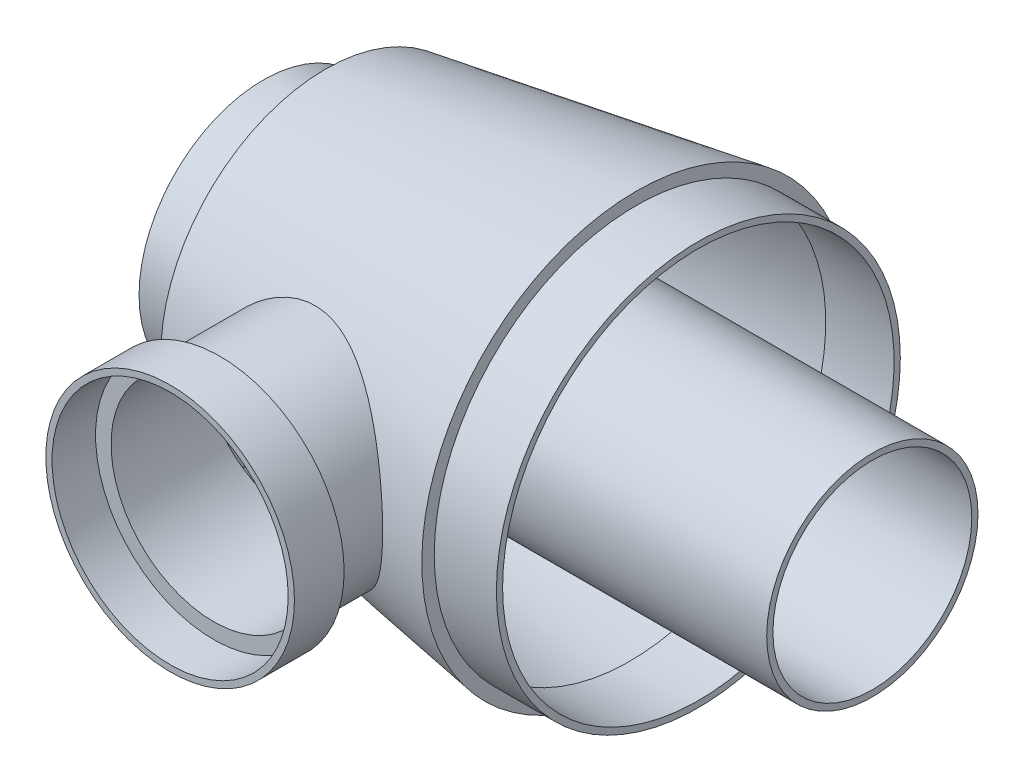
ISO-10303-21;
HEADER;
FILE_DESCRIPTION(('STEP AP214'),'2;1');
FILE_NAME('part.step','',(''),(''),'','','');
FILE_SCHEMA(('AUTOMOTIVE_DESIGN { 1 0 10303 214 1 1 1 1 }'));
ENDSEC;
DATA;
#1=APPLICATION_CONTEXT('core data for automotive mechanical design processes');
#2=APPLICATION_PROTOCOL_DEFINITION('international standard','automotive_design',2000,#1);
#3=PRODUCT_CONTEXT('',#1,'mechanical');
#4=PRODUCT('Part','Part','',(#3));
#5=PRODUCT_RELATED_PRODUCT_CATEGORY('part','',(#4));
#6=PRODUCT_DEFINITION_FORMATION('','',#4);
#7=PRODUCT_DEFINITION_CONTEXT('part definition',#1,'design');
#8=PRODUCT_DEFINITION('design','',#6,#7);
#9=PRODUCT_DEFINITION_SHAPE('','',#8);
#10=(LENGTH_UNIT() NAMED_UNIT(*) SI_UNIT(.MILLI.,.METRE.));
#11=(NAMED_UNIT(*) PLANE_ANGLE_UNIT() SI_UNIT($,.RADIAN.));
#12=(NAMED_UNIT(*) SI_UNIT($,.STERADIAN.) SOLID_ANGLE_UNIT());
#13=UNCERTAINTY_MEASURE_WITH_UNIT(LENGTH_MEASURE(1.E-05),#10,'distance_accuracy_value','');
#14=(GEOMETRIC_REPRESENTATION_CONTEXT(3) GLOBAL_UNCERTAINTY_ASSIGNED_CONTEXT((#13)) GLOBAL_UNIT_ASSIGNED_CONTEXT((#10,
#11,#12)) REPRESENTATION_CONTEXT('',''));
#15=CARTESIAN_POINT('',(0.,0.,0.));
#16=DIRECTION('',(0.,0.,1.));
#17=DIRECTION('',(1.,0.,0.));
#18=AXIS2_PLACEMENT_3D('',#15,#16,#17);
#19=CARTESIAN_POINT('',(35.,0.,42.));
#20=DIRECTION('',(0.,0.,1.));
#21=DIRECTION('',(1.,0.,0.));
#22=AXIS2_PLACEMENT_3D('',#19,#20,#21);
#23=CYLINDRICAL_SURFACE('',#22,20.);
#24=CARTESIAN_POINT('',(35.,0.,42.));
#25=DIRECTION('',(0.,0.,1.));
#26=DIRECTION('',(1.,0.,0.));
#27=AXIS2_PLACEMENT_3D('',#24,#25,#26);
#28=CIRCLE('',#27,20.);
#29=CARTESIAN_POINT('',(55.,0.,42.));
#30=VERTEX_POINT('',#29);
#31=EDGE_CURVE('E19',#30,#30,#28,.T.);
#32=ORIENTED_EDGE('',*,*,#31,.T.);
#33=EDGE_LOOP('',(#32));
#34=FACE_BOUND('',#33,.T.);
#35=CARTESIAN_POINT('',(35.,0.,50.));
#36=DIRECTION('',(0.,0.,1.));
#37=DIRECTION('',(1.,0.,0.));
#38=AXIS2_PLACEMENT_3D('',#35,#36,#37);
#39=CIRCLE('',#38,20.);
#40=CARTESIAN_POINT('',(55.,0.,50.));
#41=VERTEX_POINT('',#40);
#42=EDGE_CURVE('E213',#41,#41,#39,.T.);
#43=ORIENTED_EDGE('',*,*,#42,.F.);
#44=EDGE_LOOP('',(#43));
#45=FACE_BOUND('',#44,.T.);
#46=ADVANCED_FACE('F16',(#34,#45),#23,.T.);
#47=CARTESIAN_POINT('',(35.,0.,42.));
#48=DIRECTION('',(0.,0.,1.));
#49=DIRECTION('',(1.,0.,0.));
#50=AXIS2_PLACEMENT_3D('',#47,#48,#49);
#51=PLANE('',#50);
#52=ORIENTED_EDGE('',*,*,#31,.F.);
#53=EDGE_LOOP('',(#52));
#54=FACE_BOUND('',#53,.T.);
#55=CARTESIAN_POINT('',(35.,0.,42.));
#56=DIRECTION('',(0.,0.,1.));
#57=DIRECTION('',(1.,0.,0.));
#58=AXIS2_PLACEMENT_3D('',#55,#56,#57);
#59=CIRCLE('',#58,17.5);
#60=CARTESIAN_POINT('',(52.5,0.,42.));
#61=VERTEX_POINT('',#60);
#62=EDGE_CURVE('E206',#61,#61,#59,.F.);
#63=ORIENTED_EDGE('',*,*,#62,.F.);
#64=EDGE_LOOP('',(#63));
#65=FACE_BOUND('',#64,.T.);
#66=ADVANCED_FACE('F223',(#54,#65),#51,.F.);
#67=CARTESIAN_POINT('',(35.,0.,50.));
#68=DIRECTION('',(0.,0.,1.));
#69=DIRECTION('',(1.,0.,0.));
#70=AXIS2_PLACEMENT_3D('',#67,#68,#69);
#71=PLANE('',#70);
#72=ORIENTED_EDGE('',*,*,#42,.T.);
#73=EDGE_LOOP('',(#72));
#74=FACE_BOUND('',#73,.T.);
#75=CARTESIAN_POINT('',(35.,0.,50.));
#76=DIRECTION('',(0.,0.,1.));
#77=DIRECTION('',(1.,0.,0.));
#78=AXIS2_PLACEMENT_3D('',#75,#76,#77);
#79=CIRCLE('',#78,19.);
#80=CARTESIAN_POINT('',(54.,0.,50.));
#81=VERTEX_POINT('',#80);
#82=EDGE_CURVE('E174',#81,#81,#79,.F.);
#83=ORIENTED_EDGE('',*,*,#82,.T.);
#84=EDGE_LOOP('',(#83));
#85=FACE_BOUND('',#84,.T.);
#86=ADVANCED_FACE('F225',(#74,#85),#71,.T.);
#87=CARTESIAN_POINT('',(70.,0.,0.));
#88=DIRECTION('',(-1.,0.,0.));
#89=DIRECTION('',(0.,0.,1.));
#90=AXIS2_PLACEMENT_3D('',#87,#88,#89);
#91=CYLINDRICAL_SURFACE('',#90,32.5);
#92=CARTESIAN_POINT('',(60.,0.,0.));
#93=DIRECTION('',(-1.,0.,0.));
#94=DIRECTION('',(0.,0.,1.));
#95=AXIS2_PLACEMENT_3D('',#92,#93,#94);
#96=CIRCLE('',#95,32.5);
#97=CARTESIAN_POINT('',(60.,0.,32.5));
#98=VERTEX_POINT('',#97);
#99=EDGE_CURVE('E208',#98,#98,#96,.F.);
#100=ORIENTED_EDGE('',*,*,#99,.T.);
#101=EDGE_LOOP('',(#100));
#102=FACE_BOUND('',#101,.T.);
#103=CARTESIAN_POINT('',(70.,0.,0.));
#104=DIRECTION('',(-1.,0.,0.));
#105=DIRECTION('',(0.,0.,1.));
#106=AXIS2_PLACEMENT_3D('',#103,#104,#105);
#107=CIRCLE('',#106,32.5);
#108=CARTESIAN_POINT('',(70.,0.,32.5));
#109=VERTEX_POINT('',#108);
#110=EDGE_CURVE('E210',#109,#109,#107,.T.);
#111=ORIENTED_EDGE('',*,*,#110,.T.);
#112=EDGE_LOOP('',(#111));
#113=FACE_BOUND('',#112,.T.);
#114=ADVANCED_FACE('F230',(#102,#113),#91,.T.);
#115=CARTESIAN_POINT('',(60.,34.5,0.));
#116=DIRECTION('',(-1.,0.,0.));
#117=DIRECTION('',(0.,0.,1.));
#118=AXIS2_PLACEMENT_3D('',#115,#116,#117);
#119=PLANE('',#118);
#120=ORIENTED_EDGE('',*,*,#99,.F.);
#121=EDGE_LOOP('',(#120));
#122=FACE_BOUND('',#121,.T.);
#123=CARTESIAN_POINT('',(60.,0.,0.));
#124=DIRECTION('',(1.,0.,0.));
#125=DIRECTION('',(0.,1.,0.));
#126=AXIS2_PLACEMENT_3D('',#123,#124,#125);
#127=CIRCLE('',#126,34.5);
#128=CARTESIAN_POINT('',(60.,34.5,0.));
#129=VERTEX_POINT('',#128);
#130=EDGE_CURVE('E146',#129,#129,#127,.F.);
#131=ORIENTED_EDGE('',*,*,#130,.F.);
#132=EDGE_LOOP('',(#131));
#133=FACE_BOUND('',#132,.T.);
#134=ADVANCED_FACE('F169',(#122,#133),#119,.F.);
#135=CARTESIAN_POINT('',(35.,0.,22.));
#136=DIRECTION('',(0.,0.,1.));
#137=DIRECTION('',(1.,0.,0.));
#138=AXIS2_PLACEMENT_3D('',#135,#136,#137);
#139=CYLINDRICAL_SURFACE('',#138,17.5);
#140=CARTESIAN_POINT('',(52.5,0.,33.3));
#141=CARTESIAN_POINT('',(52.5000001885617,-0.435514880047638,33.3000001647978));
#142=CARTESIAN_POINT('',(52.4837205137714,-0.871027411837084,33.288833379642));
#143=CARTESIAN_POINT('',(52.4188637930748,-1.73849528465294,33.2444253033912));
#144=CARTESIAN_POINT('',(52.3702868694326,-2.17045063913908,33.2111840958606));
#145=CARTESIAN_POINT('',(52.2415761391305,-3.02752388525962,33.1233690582033));
#146=CARTESIAN_POINT('',(52.1614344615851,-3.45264004395322,33.0687899073406));
#147=CARTESIAN_POINT('',(51.9707695009141,-4.29285236538596,32.9394834890912));
#148=CARTESIAN_POINT('',(51.860245810111,-4.7079483935899,32.864755951346));
#149=CARTESIAN_POINT('',(51.6108886236791,-5.52353065288265,32.6970736088742));
#150=CARTESIAN_POINT('',(51.4721897023269,-5.92407604323885,32.6042055275321));
#151=CARTESIAN_POINT('',(51.1678222816258,-6.71038546833239,32.4017703364357));
#152=CARTESIAN_POINT('',(51.0021539318685,-7.09614958504251,32.2922033193057));
#153=CARTESIAN_POINT('',(50.6455907022969,-7.85109964612951,32.0582757546495));
#154=CARTESIAN_POINT('',(50.4546978635142,-8.2202869285809,31.9339164041214));
#155=CARTESIAN_POINT('',(50.0493038392447,-8.94088669598188,31.6723166441191));
#156=CARTESIAN_POINT('',(49.8347922594044,-9.29229125484885,31.5350705672787));
#157=CARTESIAN_POINT('',(49.3654045980992,-10.0040717640414,31.2380686202952));
#158=CARTESIAN_POINT('',(49.1086621512373,-10.3628311834943,31.0773897966443));
#159=CARTESIAN_POINT('',(48.5714024328761,-11.0571133689343,30.7458679388734));
#160=CARTESIAN_POINT('',(48.2908824075215,-11.3926334352024,30.5750237281103));
#161=CARTESIAN_POINT('',(47.707580017081,-12.0398216567162,30.225581436072));
#162=CARTESIAN_POINT('',(47.404783755731,-12.3514746716692,30.046978543747));
#163=CARTESIAN_POINT('',(46.7785394103549,-12.9500446630985,29.6846154029511));
#164=CARTESIAN_POINT('',(46.4550900934565,-13.2369601604756,29.5008548469641));
#165=CARTESIAN_POINT('',(45.7319440771263,-13.8322277277014,29.0991027890746));
#166=CARTESIAN_POINT('',(45.3286510849446,-14.1358914850356,28.8806178225669));
#167=CARTESIAN_POINT('',(44.4971423408468,-14.7074424944182,28.4441060058974));
#168=CARTESIAN_POINT('',(44.0689227476929,-14.9753242113168,28.2260792317362));
#169=CARTESIAN_POINT('',(43.1890520091183,-15.4740158027962,27.7947919226038));
#170=CARTESIAN_POINT('',(42.7373989912583,-15.7048227088735,27.5815317704618));
#171=CARTESIAN_POINT('',(41.8121817001478,-16.127703136979,27.1644031015593));
#172=CARTESIAN_POINT('',(41.3386212881079,-16.3197834528896,26.9605329423441));
#173=CARTESIAN_POINT('',(40.4431947787179,-16.6376837151577,26.5963652213721));
#174=CARTESIAN_POINT('',(40.0241167562621,-16.769109746912,26.4340970552161));
#175=CARTESIAN_POINT('',(39.1725919032671,-17.0010035169377,26.1231520842414));
#176=CARTESIAN_POINT('',(38.7401476430482,-17.1014771670802,25.9744726878027));
#177=CARTESIAN_POINT('',(37.8639669328961,-17.2698142096295,25.6941171167669));
#178=CARTESIAN_POINT('',(37.4202416023485,-17.3377084951832,25.5624249211881));
#179=CARTESIAN_POINT('',(36.523414205113,-17.4394043647639,25.3191112631481));
#180=CARTESIAN_POINT('',(36.0703121882672,-17.4732061299634,25.2074896940312));
#181=CARTESIAN_POINT('',(35.1538221348332,-17.5053803154321,25.0063724890001));
#182=CARTESIAN_POINT('',(34.6903791443841,-17.5034454636346,24.9170754448765));
#183=CARTESIAN_POINT('',(33.7608732806475,-17.4622717598489,24.7641933706335));
#184=CARTESIAN_POINT('',(33.2948104414534,-17.4230333921977,24.700608006697));
#185=CARTESIAN_POINT('',(32.3647074804768,-17.3067839898081,24.6004657435728));
#186=CARTESIAN_POINT('',(31.900666496604,-17.2297910606023,24.5638959098988));
#187=CARTESIAN_POINT('',(30.9790585527083,-17.0382944510775,24.5177546858264));
#188=CARTESIAN_POINT('',(30.5214910013201,-16.9237942205359,24.508180813221));
#189=CARTESIAN_POINT('',(29.6773176305309,-16.675915870004,24.5142599625784));
#190=CARTESIAN_POINT('',(29.2893477214467,-16.5470543206926,24.5267361723959));
#191=CARTESIAN_POINT('',(28.5242202967475,-16.2628660625055,24.5694124122359));
#192=CARTESIAN_POINT('',(28.1470632493092,-16.1075382097036,24.5996132084883));
#193=CARTESIAN_POINT('',(27.4057310541674,-15.7715810942508,24.6756906876631));
#194=CARTESIAN_POINT('',(27.0415597750358,-15.5909443695754,24.7215719995648));
#195=CARTESIAN_POINT('',(26.3281299907874,-15.2056915103234,24.8266235629821));
#196=CARTESIAN_POINT('',(25.978872573067,-15.0010736312966,24.8857947815264));
#197=CARTESIAN_POINT('',(25.2763627250643,-14.5562330831914,25.0187436513646));
#198=CARTESIAN_POINT('',(24.9241215196031,-14.3146126254544,25.0931834013906));
#199=CARTESIAN_POINT('',(24.2393925734692,-13.8072801824645,25.2510855287426));
#200=CARTESIAN_POINT('',(23.906912846272,-13.5415585327886,25.3345515281395));
#201=CARTESIAN_POINT('',(23.2629142204999,-12.9873540699492,25.5075075434977));
#202=CARTESIAN_POINT('',(22.9514048122304,-12.6988610780232,25.5970002507359));
#203=CARTESIAN_POINT('',(22.3507081126254,-12.10062226396,25.7790496391801));
#204=CARTESIAN_POINT('',(22.0615139021038,-11.7908830862691,25.8716053578283));
#205=CARTESIAN_POINT('',(21.4640206291457,-11.102496810575,26.0712197339636));
#206=CARTESIAN_POINT('',(21.1595359513443,-10.7205454781855,26.1783371334227));
#207=CARTESIAN_POINT('',(20.5831085787734,-9.93186023769735,26.3891014546844));
#208=CARTESIAN_POINT('',(20.3111697762292,-9.52512337420889,26.4927479603307));
#209=CARTESIAN_POINT('',(19.8015359307782,-8.68887233935458,26.692941701183));
#210=CARTESIAN_POINT('',(19.5638511411799,-8.25935140041192,26.789486806499));
#211=CARTESIAN_POINT('',(19.1246808460303,-7.38008499940052,26.9720851483386));
#212=CARTESIAN_POINT('',(18.923189919941,-6.93034257841727,27.0581399553101));
#213=CARTESIAN_POINT('',(18.5735360891063,-6.05191042809246,27.2101211065048));
#214=CARTESIAN_POINT('',(18.4223160588068,-5.62462367457826,27.2771308326202));
#215=CARTESIAN_POINT('',(18.153064586301,-4.75780479728101,27.3978823067612));
#216=CARTESIAN_POINT('',(18.0350363223189,-4.31827150527614,27.4516227841511));
#217=CARTESIAN_POINT('',(17.8336082683842,-3.4309593640391,27.5440867723587));
#218=CARTESIAN_POINT('',(17.7501227135078,-2.98320385474274,27.5828474599982));
#219=CARTESIAN_POINT('',(17.618283138227,-2.08164431089274,27.6443368492865));
#220=CARTESIAN_POINT('',(17.5699085773306,-1.62784397117048,27.6670749241922));
#221=CARTESIAN_POINT('',(17.5262322204475,-0.977612064182942,27.6876326767116));
#222=CARTESIAN_POINT('',(17.5163986764441,-0.782265258662365,27.6922668714081));
#223=CARTESIAN_POINT('',(17.5032815147621,-0.391287499017272,27.6984514329303));
#224=CARTESIAN_POINT('',(17.499998440106,-0.195656522680652,27.7000015440908));
#225=CARTESIAN_POINT('',(17.5000037114248,0.465521682802774,27.6999963261754));
#226=CARTESIAN_POINT('',(17.5186016539162,0.931187982797091,27.6912087721844));
#227=CARTESIAN_POINT('',(17.5928011160104,1.85911370886413,27.656324892269));
#228=CARTESIAN_POINT('',(17.6484255568552,2.32137084516253,27.6302178447516));
#229=CARTESIAN_POINT('',(17.7962136731854,3.239837928326,27.5614534780341));
#230=CARTESIAN_POINT('',(17.8884595303035,3.69603187283546,27.5187589397028));
#231=CARTESIAN_POINT('',(18.1084581062748,4.59796534088753,27.418190452287));
#232=CARTESIAN_POINT('',(18.2362056226055,5.04370638585972,27.3603187273843));
#233=CARTESIAN_POINT('',(18.525318850132,5.92004061628944,27.2314754988789));
#234=CARTESIAN_POINT('',(18.6865399182106,6.35068995154468,27.1605605025107));
#235=CARTESIAN_POINT('',(19.0415109249152,7.19631331921828,27.0076230522582));
#236=CARTESIAN_POINT('',(19.2352619782466,7.6112868138753,26.9256002177601));
#237=CARTESIAN_POINT('',(19.6537647573784,8.42328030059347,26.7529291158927));
#238=CARTESIAN_POINT('',(19.878509678318,8.82030420823998,26.6622827432161));
#239=CARTESIAN_POINT('',(20.3575729573521,9.59461428550394,26.4750667748695));
#240=CARTESIAN_POINT('',(20.6118923667846,9.97189975275152,26.3784969686862));
#241=CARTESIAN_POINT('',(21.1650653039191,10.7273912412964,26.1764030786938));
#242=CARTESIAN_POINT('',(21.4656880851636,11.1042528871753,26.0706919106337));
#243=CARTESIAN_POINT('',(22.0970527346055,11.8319919458249,25.8597033102133));
#244=CARTESIAN_POINT('',(22.4277959036973,12.1828682351046,25.7544258967924));
#245=CARTESIAN_POINT('',(23.1180136373974,12.8569514336609,25.5483091518454));
#246=CARTESIAN_POINT('',(23.4775025175717,13.1801443884097,25.4474720708876));
#247=CARTESIAN_POINT('',(24.2236181009056,13.7968824748227,25.2545519587817));
#248=CARTESIAN_POINT('',(24.6102583794879,14.0904125938929,25.162473361742));
#249=CARTESIAN_POINT('',(25.4230098160746,14.6555423050323,24.9885539437974));
#250=CARTESIAN_POINT('',(25.8500401238753,14.9259746274561,24.9071999808744));
#251=CARTESIAN_POINT('',(26.7281503947872,15.429923556908,24.763876332879));
#252=CARTESIAN_POINT('',(27.1792145874679,15.6634639820815,24.7018941155157));
#253=CARTESIAN_POINT('',(28.1015424037587,16.0909669834629,24.6020903780272));
#254=CARTESIAN_POINT('',(28.5727749825542,16.2849879151772,24.5642330558864));
#255=CARTESIAN_POINT('',(29.5316303896368,16.6314947116193,24.5165747683613));
#256=CARTESIAN_POINT('',(30.0192495592468,16.7839897796235,24.506767581707));
#257=CARTESIAN_POINT('',(30.9379605332263,17.0277360777489,24.5171605507704));
#258=CARTESIAN_POINT('',(31.3676400899309,17.1245166367544,24.533432222474));
#259=CARTESIAN_POINT('',(32.2315520348977,17.2852153958602,24.5896317343174));
#260=CARTESIAN_POINT('',(32.6657839825681,17.3491367467374,24.6295573055608));
#261=CARTESIAN_POINT('',(33.5351213007296,17.4440648788335,24.7328198622028));
#262=CARTESIAN_POINT('',(33.9702268283901,17.475065081448,24.7961615234103));
#263=CARTESIAN_POINT('',(34.8377070852669,17.5046287200725,24.9450514671758));
#264=CARTESIAN_POINT('',(35.2700817819588,17.5031917704782,25.0306000137114));
#265=CARTESIAN_POINT('',(36.0973209937646,17.4701009739637,25.2148813661205));
#266=CARTESIAN_POINT('',(36.4926007693681,17.4406827462883,25.3121771162279));
#267=CARTESIAN_POINT('',(37.2762919332233,17.3558033956794,25.5222302698023));
#268=CARTESIAN_POINT('',(37.6647011173631,17.3003340672228,25.6349925369535));
#269=CARTESIAN_POINT('',(38.4329389960852,17.1644129222405,25.8738318436419));
#270=CARTESIAN_POINT('',(38.8127678456648,17.0839615573841,25.9999086424284));
#271=CARTESIAN_POINT('',(39.5625275647684,16.8991876021323,26.2631477769459));
#272=CARTESIAN_POINT('',(39.9324580459977,16.7948640768051,26.400310546713));
#273=CARTESIAN_POINT('',(41.1394191639469,16.4115229280071,26.8692711051179));
#274=CARTESIAN_POINT('',(41.953789809296,16.0826313323453,27.2207464480039));
#275=CARTESIAN_POINT('',(43.125053317887,15.505601302697,27.7647837804665));
#276=CARTESIAN_POINT('',(43.5073815241038,15.299108017455,27.9490896603059));
#277=CARTESIAN_POINT('',(44.2547390026713,14.8589269711023,28.3206725321907));
#278=CARTESIAN_POINT('',(44.619767225811,14.6252375635612,28.5079497035224));
#279=CARTESIAN_POINT('',(45.3996224105337,14.0841851467013,28.9186191025356));
#280=CARTESIAN_POINT('',(45.8105915981076,13.7712849366772,29.1420563914461));
#281=CARTESIAN_POINT('',(46.6046271790621,13.1091534373625,29.5848507245715));
#282=CARTESIAN_POINT('',(46.9876889220987,12.7599161164902,29.8042070842484));
#283=CARTESIAN_POINT('',(47.7235596634945,12.0262532820401,30.2344630515727));
#284=CARTESIAN_POINT('',(48.0763795386315,11.6418405233658,30.4453656850317));
#285=CARTESIAN_POINT('',(48.5808536944968,11.0398801374827,30.7521033940362));
#286=CARTESIAN_POINT('',(48.7448780812918,10.8350142115877,30.8527417102087));
#287=CARTESIAN_POINT('',(49.064393796179,10.4169127045727,31.0503316611592));
#288=CARTESIAN_POINT('',(49.2198829149269,10.2036749806941,31.1472823394208));
#289=CARTESIAN_POINT('',(49.621993774098,9.62501336043149,31.3997911163116));
#290=CARTESIAN_POINT('',(49.8607141220181,9.25239335986416,31.5516051545745));
#291=CARTESIAN_POINT('',(50.31126521356,8.48602999112209,31.8409045850368));
#292=CARTESIAN_POINT('',(50.5231008673783,8.09229049893479,31.9783925929063));
#293=CARTESIAN_POINT('',(50.9176796951318,7.28552852061569,32.2365036512779));
#294=CARTESIAN_POINT('',(51.1004445193146,6.87252068370759,32.3571392442404));
#295=CARTESIAN_POINT('',(51.4348926404308,6.02910076115754,32.5792664035894));
#296=CARTESIAN_POINT('',(51.5865774142271,5.59868950365606,32.6807588796009));
#297=CARTESIAN_POINT('',(51.8488417280902,4.74894175308454,32.8570587201349));
#298=CARTESIAN_POINT('',(51.9613143763606,4.33044313955341,32.9330846209898));
#299=CARTESIAN_POINT('',(52.1553590786361,3.48317269239629,33.0646572124483));
#300=CARTESIAN_POINT('',(52.2369327524217,3.05440139853615,33.1202049765491));
#301=CARTESIAN_POINT('',(52.3679488053152,2.18984997482909,33.2095851646815));
#302=CARTESIAN_POINT('',(52.4174003094982,1.75407187151375,33.2434237556925));
#303=CARTESIAN_POINT('',(52.483425766161,0.87886170849194,33.2886310590805));
#304=CARTESIAN_POINT('',(52.4999998097433,0.439429658913859,33.2999998337209));
#305=CARTESIAN_POINT('',(52.5,0.,33.3));
#306=B_SPLINE_CURVE_WITH_KNOTS('',3,(#140,#141,#142,#143,#144,#145,#146,#147,#148,#149,#150,
#151,#152,#153,#154,#155,#156,#157,#158,#159,#160,#161,#162,#163,#164,#165,#166,#167,#168,#169,
#170,#171,#172,#173,#174,#175,#176,#177,#178,#179,#180,#181,#182,#183,#184,#185,#186,#187,#188,
#189,#190,#191,#192,#193,#194,#195,#196,#197,#198,#199,#200,#201,#202,#203,#204,#205,#206,#207,
#208,#209,#210,#211,#212,#213,#214,#215,#216,#217,#218,#219,#220,#221,#222,#223,#224,#225,#226,
#227,#228,#229,#230,#231,#232,#233,#234,#235,#236,#237,#238,#239,#240,#241,#242,#243,#244,#245,
#246,#247,#248,#249,#250,#251,#252,#253,#254,#255,#256,#257,#258,#259,#260,#261,#262,#263,#264,
#265,#266,#267,#268,#269,#270,#271,#272,#273,#274,#275,#276,#277,#278,#279,#280,#281,#282,#283,
#284,#285,#286,#287,#288,#289,#290,#291,#292,#293,#294,#295,#296,#297,#298,#299,#300,#301,#302,
#303,#304,#305),.UNSPECIFIED.,.T.,.F.,(4,2,2,2,2,2,2,2,2,2,2,2,2,2,2,2,2,2,2,2,2,2,2,2,2,2,2,2,
2,2,2,2,2,2,2,2,2,2,2,2,2,2,2,2,2,2,2,2,2,2,2,2,2,2,2,2,2,2,2,2,2,2,2,2,2,2,2,2,2,2,2,2,2,2,2,2,
2,2,2,2,2,2,4),(0.,1.30609738616659,2.61218982802123,3.91860815929132,5.22504402143357,
6.52538073873394,7.82571024368848,9.12593459724809,10.4267334701219,11.8339124439858,
13.2412546168023,14.6494822800555,16.0577940853806,17.7062699206525,19.3550004652568,
21.0038629545752,22.652435928504,24.0557958696115,25.4588876040812,26.8606462248404,
28.2623973964205,29.6762067313173,31.0899977100141,32.5031113548699,33.9160950634387,
35.1417133313506,36.3673845863625,37.5934179796365,38.8195406131113,40.1190232821415,
41.4190293587581,42.719619863639,44.0198054653771,45.5183126743981,47.0169989141496,
48.5161328304159,50.0150420428506,51.3880973659591,52.7612841190427,54.1310406720864,
55.4999952483696,56.0868319395413,56.6737172764194,58.0700819152905,59.4673117781457,
60.8676950322345,62.2678731779584,63.6621224213803,65.0564194513125,66.4504108421958,
67.8444518029797,69.3234256682227,70.8024634404186,72.2822424268559,73.7627666292193,
75.2964987541153,76.8292365878309,78.3596944661098,79.889812876155,81.2102182966183,
82.5304970834987,83.8510396509243,85.1715979166172,86.3947950675056,87.6183777572214,
88.8419383261449,90.0655468229343,92.8914083660586,94.3066325705484,95.7219424961323,
97.4084072910851,99.0951524695632,100.781288425911,101.624270554907,102.467469869744,
103.869520622954,105.271314937226,106.672060339337,108.072739165344,109.391024270923,
110.709240260027,112.027081614206,113.344919316672),.UNSPECIFIED.);
#307=CARTESIAN_POINT('',(52.5,0.,33.3));
#308=VERTEX_POINT('',#307);
#309=EDGE_CURVE('E139',#308,#308,#306,.T.);
#310=ORIENTED_EDGE('',*,*,#309,.F.);
#311=EDGE_LOOP('',(#310));
#312=FACE_BOUND('',#311,.T.);
#313=ORIENTED_EDGE('',*,*,#62,.T.);
#314=EDGE_LOOP('',(#313));
#315=FACE_BOUND('',#314,.T.);
#316=ADVANCED_FACE('F148',(#312,#315),#139,.T.);
#317=CARTESIAN_POINT('',(35.,0.,42.));
#318=DIRECTION('',(0.,0.,1.));
#319=DIRECTION('',(1.,0.,0.));
#320=AXIS2_PLACEMENT_3D('',#317,#318,#319);
#321=CYLINDRICAL_SURFACE('',#320,19.);
#322=ORIENTED_EDGE('',*,*,#82,.F.);
#323=EDGE_LOOP('',(#322));
#324=FACE_BOUND('',#323,.T.);
#325=CARTESIAN_POINT('',(35.,0.,43.));
#326=DIRECTION('',(0.,0.,1.));
#327=DIRECTION('',(1.,0.,0.));
#328=AXIS2_PLACEMENT_3D('',#325,#326,#327);
#329=CIRCLE('',#328,19.);
#330=CARTESIAN_POINT('',(54.,0.,43.));
#331=VERTEX_POINT('',#330);
#332=EDGE_CURVE('E136',#331,#331,#329,.T.);
#333=ORIENTED_EDGE('',*,*,#332,.F.);
#334=EDGE_LOOP('',(#333));
#335=FACE_BOUND('',#334,.T.);
#336=ADVANCED_FACE('F162',(#324,#335),#321,.F.);
#337=CARTESIAN_POINT('',(70.,32.5,0.));
#338=DIRECTION('',(-1.,0.,0.));
#339=DIRECTION('',(0.,0.,1.));
#340=AXIS2_PLACEMENT_3D('',#337,#338,#339);
#341=PLANE('',#340);
#342=ORIENTED_EDGE('',*,*,#110,.F.);
#343=EDGE_LOOP('',(#342));
#344=FACE_BOUND('',#343,.T.);
#345=CARTESIAN_POINT('',(70.,0.,0.));
#346=DIRECTION('',(-1.,0.,0.));
#347=DIRECTION('',(0.,0.,1.));
#348=AXIS2_PLACEMENT_3D('',#345,#346,#347);
#349=CIRCLE('',#348,31.5);
#350=CARTESIAN_POINT('',(70.,0.,31.5));
#351=VERTEX_POINT('',#350);
#352=EDGE_CURVE('E131',#351,#351,#349,.T.);
#353=ORIENTED_EDGE('',*,*,#352,.T.);
#354=EDGE_LOOP('',(#353));
#355=FACE_BOUND('',#354,.T.);
#356=ADVANCED_FACE('F158',(#344,#355),#341,.F.);
#357=CARTESIAN_POINT('',(60.,0.,0.));
#358=DIRECTION('',(1.,0.,0.));
#359=DIRECTION('',(0.,1.,0.));
#360=AXIS2_PLACEMENT_3D('',#357,#358,#359);
#361=CONICAL_SURFACE('',#360,34.5,0.158655262186401);
#362=CARTESIAN_POINT('',(10.,0.,0.));
#363=DIRECTION('',(1.,0.,0.));
#364=DIRECTION('',(0.,1.,0.));
#365=AXIS2_PLACEMENT_3D('',#362,#363,#364);
#366=CIRCLE('',#365,26.5);
#367=CARTESIAN_POINT('',(10.,26.5,0.));
#368=VERTEX_POINT('',#367);
#369=EDGE_CURVE('E128',#368,#368,#366,.T.);
#370=ORIENTED_EDGE('',*,*,#369,.T.);
#371=EDGE_LOOP('',(#370));
#372=FACE_BOUND('',#371,.T.);
#373=ORIENTED_EDGE('',*,*,#130,.T.);
#374=EDGE_LOOP('',(#373));
#375=FACE_BOUND('',#374,.T.);
#376=ORIENTED_EDGE('',*,*,#309,.T.);
#377=EDGE_LOOP('',(#376));
#378=FACE_BOUND('',#377,.T.);
#379=ADVANCED_FACE('F152',(#372,#375,#378),#361,.T.);
#380=CARTESIAN_POINT('',(35.,0.,43.));
#381=DIRECTION('',(0.,0.,1.));
#382=DIRECTION('',(1.,0.,0.));
#383=AXIS2_PLACEMENT_3D('',#380,#381,#382);
#384=PLANE('',#383);
#385=ORIENTED_EDGE('',*,*,#332,.T.);
#386=EDGE_LOOP('',(#385));
#387=FACE_BOUND('',#386,.T.);
#388=CARTESIAN_POINT('',(35.,0.,43.));
#389=DIRECTION('',(0.,0.,1.));
#390=DIRECTION('',(1.,0.,0.));
#391=AXIS2_PLACEMENT_3D('',#388,#389,#390);
#392=CIRCLE('',#391,16.5);
#393=CARTESIAN_POINT('',(51.5,0.,43.));
#394=VERTEX_POINT('',#393);
#395=EDGE_CURVE('E125',#394,#394,#392,.F.);
#396=ORIENTED_EDGE('',*,*,#395,.T.);
#397=EDGE_LOOP('',(#396));
#398=FACE_BOUND('',#397,.T.);
#399=ADVANCED_FACE('F157',(#387,#398),#384,.T.);
#400=CARTESIAN_POINT('',(70.,0.,0.));
#401=DIRECTION('',(-1.,0.,0.));
#402=DIRECTION('',(0.,0.,1.));
#403=AXIS2_PLACEMENT_3D('',#400,#401,#402);
#404=CYLINDRICAL_SURFACE('',#403,31.5);
#405=CARTESIAN_POINT('',(59.,0.,0.));
#406=DIRECTION('',(-1.,0.,0.));
#407=DIRECTION('',(0.,0.,1.));
#408=AXIS2_PLACEMENT_3D('',#405,#406,#407);
#409=CIRCLE('',#408,31.5);
#410=CARTESIAN_POINT('',(59.,0.,31.5));
#411=VERTEX_POINT('',#410);
#412=EDGE_CURVE('E127',#411,#411,#409,.F.);
#413=ORIENTED_EDGE('',*,*,#412,.F.);
#414=EDGE_LOOP('',(#413));
#415=FACE_BOUND('',#414,.T.);
#416=ORIENTED_EDGE('',*,*,#352,.F.);
#417=EDGE_LOOP('',(#416));
#418=FACE_BOUND('',#417,.T.);
#419=ADVANCED_FACE('F178',(#415,#418),#404,.F.);
#420=CARTESIAN_POINT('',(10.,20.,0.));
#421=DIRECTION('',(1.,0.,0.));
#422=DIRECTION('',(0.,0.,-1.));
#423=AXIS2_PLACEMENT_3D('',#420,#421,#422);
#424=PLANE('',#423);
#425=ORIENTED_EDGE('',*,*,#369,.F.);
#426=EDGE_LOOP('',(#425));
#427=FACE_BOUND('',#426,.T.);
#428=CARTESIAN_POINT('',(10.,0.,0.));
#429=DIRECTION('',(-1.,0.,0.));
#430=DIRECTION('',(0.,0.,1.));
#431=AXIS2_PLACEMENT_3D('',#428,#429,#430);
#432=CIRCLE('',#431,20.);
#433=CARTESIAN_POINT('',(10.,0.,20.));
#434=VERTEX_POINT('',#433);
#435=EDGE_CURVE('E58',#434,#434,#432,.T.);
#436=ORIENTED_EDGE('',*,*,#435,.F.);
#437=EDGE_LOOP('',(#436));
#438=FACE_BOUND('',#437,.T.);
#439=ADVANCED_FACE('F82',(#427,#438),#424,.F.);
#440=CARTESIAN_POINT('',(35.,0.,22.));
#441=DIRECTION('',(0.,0.,1.));
#442=DIRECTION('',(1.,0.,0.));
#443=AXIS2_PLACEMENT_3D('',#440,#441,#442);
#444=CYLINDRICAL_SURFACE('',#443,16.5);
#445=CARTESIAN_POINT('',(18.5,0.,26.8472808879062));
#446=CARTESIAN_POINT('',(18.4999972960706,0.441476725385383,26.8472834646836));
#447=CARTESIAN_POINT('',(18.5177335270334,0.882918744715685,26.839205434161));
#448=CARTESIAN_POINT('',(18.5884596418095,1.76235480687901,26.8071683430926));
#449=CARTESIAN_POINT('',(18.6414460259123,2.20034918763346,26.7832108590937));
#450=CARTESIAN_POINT('',(18.7820626361899,3.06958554876211,26.7202019259078));
#451=CARTESIAN_POINT('',(18.8696903447222,3.50082801748063,26.6811515736363));
#452=CARTESIAN_POINT('',(19.0786537977592,4.35355654098534,26.5892184874113));
#453=CARTESIAN_POINT('',(19.1999906962629,4.77504226122418,26.536335279908));
#454=CARTESIAN_POINT('',(19.4747555842381,5.60419090643602,26.4186003971501));
#455=CARTESIAN_POINT('',(19.6280824149497,6.01189280566265,26.3537865234192));
#456=CARTESIAN_POINT('',(19.9657259756215,6.81243999610833,26.2140950659685));
#457=CARTESIAN_POINT('',(20.1500424290822,7.20528541984335,26.1392175720408));
#458=CARTESIAN_POINT('',(20.5483479727599,7.97416368084615,25.9816722240363));
#459=CARTESIAN_POINT('',(20.7623474599764,8.35019056582948,25.8990016435601));
#460=CARTESIAN_POINT('',(21.2185884322744,9.08345639996443,25.7284404880546));
#461=CARTESIAN_POINT('',(21.4608311767688,9.44069451026238,25.6405496803326));
#462=CARTESIAN_POINT('',(21.9868879694205,10.1546363718276,25.4572002079154));
#463=CARTESIAN_POINT('',(22.2722894834848,10.5101342319082,25.3615966185145));
#464=CARTESIAN_POINT('',(22.8716317394422,11.1964396071245,25.1711597564151));
#465=CARTESIAN_POINT('',(23.1855735914585,11.5272461609391,25.0763265138369));
#466=CARTESIAN_POINT('',(23.8406587854718,12.1625406945184,24.8911303043594));
#467=CARTESIAN_POINT('',(24.1818178634613,12.4670132338104,24.8007699731714));
#468=CARTESIAN_POINT('',(24.8895248167627,13.0475179747765,24.6285530085719));
#469=CARTESIAN_POINT('',(25.2560707969178,13.3235522955727,24.5466957415364));
#470=CARTESIAN_POINT('',(26.0240387668671,13.8530164478248,24.3933194141082));
#471=CARTESIAN_POINT('',(26.4261760387345,14.1055230684003,24.3221828651065));
#472=CARTESIAN_POINT('',(27.252899814412,14.5759593722016,24.1977557945794));
#473=CARTESIAN_POINT('',(27.6774868398219,14.7938882515737,24.1444656879112));
#474=CARTESIAN_POINT('',(28.5451229800515,15.1925006698656,24.0599920150801));
#475=CARTESIAN_POINT('',(28.9881406170856,15.3732448116887,24.0287722734681));
#476=CARTESIAN_POINT('',(29.8891474229746,15.6957957062552,23.9917909742235));
#477=CARTESIAN_POINT('',(30.3471335907324,15.8376102112044,23.9860243445626));
#478=CARTESIAN_POINT('',(31.2128812400219,16.0649055130986,24.001202730188));
#479=CARTESIAN_POINT('',(31.6194161773734,16.1553174752,24.0187669157791));
#480=CARTESIAN_POINT('',(32.4366720074462,16.3049645990835,24.0755238507281));
#481=CARTESIAN_POINT('',(32.8473925140175,16.3642026108223,24.1147146222884));
#482=CARTESIAN_POINT('',(33.6696016134861,16.4514745894113,24.2144694198639));
#483=CARTESIAN_POINT('',(34.0810903306248,16.4795029731749,24.2750372674701));
#484=CARTESIAN_POINT('',(34.9015008371169,16.5048096507067,24.416442066387));
#485=CARTESIAN_POINT('',(35.3104225919548,16.5020875318848,24.4972792896447));
#486=CARTESIAN_POINT('',(36.0963595990774,16.4679239680398,24.6715783643301));
#487=CARTESIAN_POINT('',(36.4737191612877,16.4383633998013,24.7638759925878));
#488=CARTESIAN_POINT('',(37.2218654874711,16.3540542319375,24.9628619443168));
#489=CARTESIAN_POINT('',(37.5926501239296,16.2992976284456,25.0695548330226));
#490=CARTESIAN_POINT('',(38.3259834549944,16.1656030576611,25.2953293297757));
#491=CARTESIAN_POINT('',(38.688532206237,16.0866652567113,25.4144108525976));
#492=CARTESIAN_POINT('',(39.4040872744293,15.9056699183099,25.6628714091528));
#493=CARTESIAN_POINT('',(39.7570932144105,15.8036114690151,25.7922508488897));
#494=CARTESIAN_POINT('',(40.9044738377187,15.4302791674961,26.232768553817));
#495=CARTESIAN_POINT('',(41.677204605655,15.1112708448275,26.561917369307));
#496=CARTESIAN_POINT('',(42.7877665200749,14.5524268638592,27.0707279994188));
#497=CARTESIAN_POINT('',(43.1501376039638,14.3525631222677,27.242991251702));
#498=CARTESIAN_POINT('',(43.858128134272,13.9267384348336,27.5900575623708));
#499=CARTESIAN_POINT('',(44.2037465956916,13.7007759571063,27.7648607693139));
#500=CARTESIAN_POINT('',(44.9378256582244,13.1805516670327,28.1458968303422));
#501=CARTESIAN_POINT('',(45.322777698433,12.8813207069525,28.3521148577728));
#502=CARTESIAN_POINT('',(46.0660419365087,12.2487090307352,28.7603958197961));
#503=CARTESIAN_POINT('',(46.4243498375694,11.9153228270258,28.9624580804184));
#504=CARTESIAN_POINT('',(47.1119773043369,11.2156370471847,29.3583207196544));
#505=CARTESIAN_POINT('',(47.4413077101093,10.8493498833452,29.5521241736578));
#506=CARTESIAN_POINT('',(48.06853406541,10.085023110213,29.9275225355706));
#507=CARTESIAN_POINT('',(48.3664370022516,9.68699059361347,30.1091201539487));
#508=CARTESIAN_POINT('',(48.8804338267573,8.93061252006225,30.426768432097));
#509=CARTESIAN_POINT('',(49.1018454324744,8.5769260914143,30.5653302491368));
#510=CARTESIAN_POINT('',(49.5190676006996,7.84998284392969,30.8289355032696));
#511=CARTESIAN_POINT('',(49.7148828038232,7.47672958978881,30.9539813900805));
#512=CARTESIAN_POINT('',(50.0788120949562,6.71255314226117,31.1881929323061));
#513=CARTESIAN_POINT('',(50.2469496321064,6.3216452678754,31.2973720211439));
#514=CARTESIAN_POINT('',(50.5537297466834,5.52395095240337,31.49779613864));
#515=CARTESIAN_POINT('',(50.6923744602782,5.11716566384724,31.5890424661335));
#516=CARTESIAN_POINT('',(50.9273743910855,4.32703590754531,31.744407988322));
#517=CARTESIAN_POINT('',(51.026390413794,3.9448141894344,31.8102157962418));
#518=CARTESIAN_POINT('',(51.197125519005,3.171717334703,31.9240252136752));
#519=CARTESIAN_POINT('',(51.2688466336579,2.78084284458922,31.9720281487838));
#520=CARTESIAN_POINT('',(51.3840052118966,1.99317709594255,32.0492390599724));
#521=CARTESIAN_POINT('',(51.4274480603473,1.59638697861703,32.0784506143727));
#522=CARTESIAN_POINT('',(51.4854461693827,0.799733515584313,32.1174720600927));
#523=CARTESIAN_POINT('',(51.5000004806843,0.399870069320328,32.1272813138488));
#524=CARTESIAN_POINT('',(51.49999950461,-0.412103407031861,32.1272804489327));
#525=CARTESIAN_POINT('',(51.4845400369871,-0.824213848560965,32.1168609283109));
#526=CARTESIAN_POINT('',(51.4229445980844,-1.64508868321091,32.0754222696589));
#527=CARTESIAN_POINT('',(51.3768078475043,-2.0538529910623,32.0444026083198));
#528=CARTESIAN_POINT('',(51.2545462338499,-2.86496098182109,31.9624529553081));
#529=CARTESIAN_POINT('',(51.1784119746445,-3.26730261182375,31.911516725199));
#530=CARTESIAN_POINT('',(50.9972562184701,-4.06252523929208,31.7908400850441));
#531=CARTESIAN_POINT('',(50.8922345452429,-4.45540617901691,31.7210995602628));
#532=CARTESIAN_POINT('',(50.6552450996292,-5.22738945746273,31.5646038263553));
#533=CARTESIAN_POINT('',(50.5234035172175,-5.60654687009001,31.4779283703925));
#534=CARTESIAN_POINT('',(50.2340329650797,-6.35088182664373,31.2889974197912));
#535=CARTESIAN_POINT('',(50.0765040967914,-6.7160594257687,31.1867419866773));
#536=CARTESIAN_POINT('',(49.7373938440739,-7.43072429269016,30.9684362532025));
#537=CARTESIAN_POINT('',(49.5558138348996,-7.78021245608677,30.8523867416321));
#538=CARTESIAN_POINT('',(49.1701406844315,-8.46231003860298,30.6083015472907));
#539=CARTESIAN_POINT('',(48.9660391743616,-8.79491311589986,30.48026141161));
#540=CARTESIAN_POINT('',(48.5196292230837,-9.4681372841102,30.2033955107996));
#541=CARTESIAN_POINT('',(48.2755677595103,-9.80724853176695,30.0537262348056));
#542=CARTESIAN_POINT('',(47.7648040939272,-10.4633960987299,29.7450156715508));
#543=CARTESIAN_POINT('',(47.4981013978205,-10.780431936012,29.5859741797844));
#544=CARTESIAN_POINT('',(46.9434589249867,-11.3918509654627,29.2607732867601));
#545=CARTESIAN_POINT('',(46.6555052644384,-11.6862190869852,29.0946092624101));
#546=CARTESIAN_POINT('',(46.0598932744459,-12.251422175771,28.7576111798732));
#547=CARTESIAN_POINT('',(45.7522331659448,-12.5222550131019,28.5867767008476));
#548=CARTESIAN_POINT('',(45.0661322784679,-13.0824362269524,28.2144353786433));
#549=CARTESIAN_POINT('',(44.6843855207068,-13.3674736565686,28.0125158758795));
#550=CARTESIAN_POINT('',(43.8973975399309,-13.9037078047756,27.6093650584028));
#551=CARTESIAN_POINT('',(43.4921528097683,-14.1548994530828,27.4081338511912));
#552=CARTESIAN_POINT('',(42.6596521862448,-14.6221607750082,27.0103638197802));
#553=CARTESIAN_POINT('',(42.2323953189399,-14.8382288927981,26.8138252037721));
#554=CARTESIAN_POINT('',(41.3573827873405,-15.2336505137521,26.4297026026955));
#555=CARTESIAN_POINT('',(40.9096306571431,-15.4130103177427,26.2421170851112));
#556=CARTESIAN_POINT('',(40.0615478625845,-15.7099421289977,25.906610649524));
#557=CARTESIAN_POINT('',(39.6637456139655,-15.8327012021267,25.7568806603229));
#558=CARTESIAN_POINT('',(38.8557135269601,-16.0486227347056,25.4702238567987));
#559=CARTESIAN_POINT('',(38.4454860203314,-16.1417907100674,25.3332946597132));
#560=CARTESIAN_POINT('',(37.6146562251406,-16.2969928084732,25.0753413401112));
#561=CARTESIAN_POINT('',(37.1940638545524,-16.3590555680124,24.9543026643183));
#562=CARTESIAN_POINT('',(36.3444102045835,-16.4506869078732,24.7308848064803));
#563=CARTESIAN_POINT('',(35.9153489661788,-16.4802556453762,24.6285055341769));
#564=CARTESIAN_POINT('',(35.0482135749608,-16.5056740592529,24.4442502954674));
#565=CARTESIAN_POINT('',(34.610094801736,-16.50125245584,24.3625446713672));
#566=CARTESIAN_POINT('',(33.7318428304836,-16.4570671188455,24.222718174645));
#567=CARTESIAN_POINT('',(33.2917096517916,-16.4173037237926,24.1645970761216));
#568=CARTESIAN_POINT('',(32.4137266488373,-16.3020593914575,24.0730226617852));
#569=CARTESIAN_POINT('',(31.9758759782083,-16.2265928113735,24.0395594442051));
#570=CARTESIAN_POINT('',(31.1066018734862,-16.0402305112719,23.9971926905686));
#571=CARTESIAN_POINT('',(30.6751778982409,-15.9293377921207,23.9882870749095));
#572=CARTESIAN_POINT('',(29.8761148560916,-15.6890902033856,23.9934281695364));
#573=CARTESIAN_POINT('',(29.5072340377644,-15.5637656851162,24.0047495318541));
#574=CARTESIAN_POINT('',(28.7800037952916,-15.2876719219036,24.0437484926946));
#575=CARTESIAN_POINT('',(28.4216548265723,-15.1369015785084,24.0714267974472));
#576=CARTESIAN_POINT('',(27.7175690175986,-14.8110346506032,24.1412243320478));
#577=CARTESIAN_POINT('',(27.371835554567,-14.6359316115846,24.1833473978893));
#578=CARTESIAN_POINT('',(26.6948297772144,-14.2626643119892,24.2798090648312));
#579=CARTESIAN_POINT('',(26.3635584884726,-14.0644984195608,24.3341485305776));
#580=CARTESIAN_POINT('',(25.6979109663454,-13.6340509218361,24.4561565158703));
#581=CARTESIAN_POINT('',(25.3644991271001,-13.4004479731209,24.5244212205179));
#582=CARTESIAN_POINT('',(24.7168295288882,-12.9101303545064,24.6691446303775));
#583=CARTESIAN_POINT('',(24.4025795943244,-12.6534063481472,24.7456066481214));
#584=CARTESIAN_POINT('',(23.7944472949043,-12.1181572595206,24.9039188764203));
#585=CARTESIAN_POINT('',(23.5005736719003,-11.8396229279675,24.9857713705946));
#586=CARTESIAN_POINT('',(22.9345388412587,-11.2622401514152,25.1520924372813));
#587=CARTESIAN_POINT('',(22.6623707028854,-10.9633982476936,25.236560162673));
#588=CARTESIAN_POINT('',(22.1037694030484,-10.3029031048189,25.4175239310858));
#589=CARTESIAN_POINT('',(21.8207645072021,-9.93834462977607,25.5140312489497));
#590=CARTESIAN_POINT('',(21.2858762665542,-9.1861744368799,25.70353677247));
#591=CARTESIAN_POINT('',(21.0339951553073,-8.79856106747807,25.7965347259497));
#592=CARTESIAN_POINT('',(20.5629565285095,-8.00223791200568,25.9757176319606));
#593=CARTESIAN_POINT('',(20.3438091506673,-7.59352164284049,26.061900469963));
#594=CARTESIAN_POINT('',(19.9400452679566,-6.75746061576205,26.2243823859436));
#595=CARTESIAN_POINT('',(19.7554295377366,-6.33011544021161,26.3006812421827));
#596=CARTESIAN_POINT('',(19.4106790427083,-5.42880498708993,26.4456310257719));
#597=CARTESIAN_POINT('',(19.2531853337702,-4.95367634728973,26.5133644383019));
#598=CARTESIAN_POINT('',(18.9816108272507,-3.98902039737284,26.6316236649886));
#599=CARTESIAN_POINT('',(18.8675329617831,-3.49949211717254,26.6821483169176));
#600=CARTESIAN_POINT('',(18.6844127308619,-2.51081334918159,26.7638399871018));
#601=CARTESIAN_POINT('',(18.615340163744,-2.0116695461323,26.7950199862824));
#602=CARTESIAN_POINT('',(18.5231386742144,-1.00833491406623,26.8367374683283));
#603=CARTESIAN_POINT('',(18.5000030877551,-0.504144827777779,26.8472779453525));
#604=CARTESIAN_POINT('',(18.5,0.,26.8472808879062));
#605=B_SPLINE_CURVE_WITH_KNOTS('',3,(#445,#446,#447,#448,#449,#450,#451,#452,#453,#454,#455,
#456,#457,#458,#459,#460,#461,#462,#463,#464,#465,#466,#467,#468,#469,#470,#471,#472,#473,#474,
#475,#476,#477,#478,#479,#480,#481,#482,#483,#484,#485,#486,#487,#488,#489,#490,#491,#492,#493,
#494,#495,#496,#497,#498,#499,#500,#501,#502,#503,#504,#505,#506,#507,#508,#509,#510,#511,#512,
#513,#514,#515,#516,#517,#518,#519,#520,#521,#522,#523,#524,#525,#526,#527,#528,#529,#530,#531,
#532,#533,#534,#535,#536,#537,#538,#539,#540,#541,#542,#543,#544,#545,#546,#547,#548,#549,#550,
#551,#552,#553,#554,#555,#556,#557,#558,#559,#560,#561,#562,#563,#564,#565,#566,#567,#568,#569,
#570,#571,#572,#573,#574,#575,#576,#577,#578,#579,#580,#581,#582,#583,#584,#585,#586,#587,#588,
#589,#590,#591,#592,#593,#594,#595,#596,#597,#598,#599,#600,#601,#602,#603,#604),.UNSPECIFIED.,
.T.,.F.,(4,2,2,2,2,2,2,2,2,2,2,2,2,2,2,2,2,2,2,2,2,2,2,2,2,2,2,2,2,2,2,2,2,2,2,2,2,2,2,2,2,2,2,
2,2,2,2,2,2,2,2,2,2,2,2,2,2,2,2,2,2,2,2,2,2,2,2,2,2,2,2,2,2,2,2,2,2,2,2,4),(0.,1.32394326518837,
2.6477551060729,3.9714707533901,5.29523172232046,6.6148684644394,7.93449343295775,
9.25458179584525,10.5747290461591,11.9705956938571,13.3665166593296,14.7632506263758,
16.1598804380271,17.59828944776,19.0367318923304,20.4728110902851,21.9086041085651,
23.1574153190757,24.4061123420532,25.6550327084144,26.9039698319881,28.0716135084902,
29.2396283593786,30.4076351756506,31.5756880643493,34.2593686928541,35.6033802562533,
36.9474707475407,38.5338613516785,40.1205072350953,41.7065570309393,43.2922534516198,
44.6100003194713,45.9275079481184,47.2438935448724,48.5601837632032,49.7596787986921,
50.9590845123416,52.1582617633146,53.3574784188391,54.5933830474376,55.8293190731304,
57.0656425396945,58.3019735499246,59.532616743874,60.7632550781948,61.993823074425,
63.2248498877946,64.5549727985381,65.885124743867,67.2161535401391,68.5473026687331,
70.0979520862393,71.6488335418693,73.1997836764781,74.7504673733916,76.0764800199922,
77.4022453466942,78.7267878774156,80.0513240009734,81.3864422700795,82.7215477506185,
84.0561168055552,85.3905728421846,86.5585143213482,87.7265062314215,88.8948085574043,
90.063193598926,91.3003322661762,92.5379727587612,93.7761409803268,95.0139122485564,
96.4267758344789,97.8397407537519,99.2531423680407,100.666575685369,102.179587804127,
103.692702086896,105.204799916788,106.716678371611),.UNSPECIFIED.);
#606=CARTESIAN_POINT('',(18.5,0.,26.8472808879062));
#607=VERTEX_POINT('',#606);
#608=EDGE_CURVE('E51',#607,#607,#605,.T.);
#609=ORIENTED_EDGE('',*,*,#608,.T.);
#610=EDGE_LOOP('',(#609));
#611=FACE_BOUND('',#610,.T.);
#612=ORIENTED_EDGE('',*,*,#395,.F.);
#613=EDGE_LOOP('',(#612));
#614=FACE_BOUND('',#613,.T.);
#615=ADVANCED_FACE('F60',(#611,#614),#444,.F.);
#616=CARTESIAN_POINT('',(59.,34.5,0.));
#617=DIRECTION('',(-1.,0.,0.));
#618=DIRECTION('',(0.,0.,1.));
#619=AXIS2_PLACEMENT_3D('',#616,#617,#618);
#620=PLANE('',#619);
#621=ORIENTED_EDGE('',*,*,#412,.T.);
#622=EDGE_LOOP('',(#621));
#623=FACE_BOUND('',#622,.T.);
#624=CARTESIAN_POINT('',(59.,0.,0.));
#625=DIRECTION('',(1.,0.,0.));
#626=DIRECTION('',(0.,1.,0.));
#627=AXIS2_PLACEMENT_3D('',#624,#625,#626);
#628=CIRCLE('',#627,33.3272808879062);
#629=CARTESIAN_POINT('',(59.,33.3272808879062,0.));
#630=VERTEX_POINT('',#629);
#631=EDGE_CURVE('E48',#630,#630,#628,.F.);
#632=ORIENTED_EDGE('',*,*,#631,.T.);
#633=EDGE_LOOP('',(#632));
#634=FACE_BOUND('',#633,.T.);
#635=ADVANCED_FACE('F74',(#623,#634),#620,.T.);
#636=CARTESIAN_POINT('',(70.,0.,0.));
#637=DIRECTION('',(-1.,0.,0.));
#638=DIRECTION('',(0.,0.,1.));
#639=AXIS2_PLACEMENT_3D('',#636,#637,#638);
#640=CYLINDRICAL_SURFACE('',#639,20.);
#641=CARTESIAN_POINT('',(0.,0.,0.));
#642=DIRECTION('',(-1.,0.,0.));
#643=DIRECTION('',(0.,0.,1.));
#644=AXIS2_PLACEMENT_3D('',#641,#642,#643);
#645=CIRCLE('',#644,20.);
#646=CARTESIAN_POINT('',(0.,0.,20.));
#647=VERTEX_POINT('',#646);
#648=EDGE_CURVE('E45',#647,#647,#645,.F.);
#649=ORIENTED_EDGE('',*,*,#648,.T.);
#650=EDGE_LOOP('',(#649));
#651=FACE_BOUND('',#650,.T.);
#652=ORIENTED_EDGE('',*,*,#435,.T.);
#653=EDGE_LOOP('',(#652));
#654=FACE_BOUND('',#653,.T.);
#655=ADVANCED_FACE('F70',(#651,#654),#640,.T.);
#656=CARTESIAN_POINT('',(59.,0.,0.));
#657=DIRECTION('',(1.,0.,0.));
#658=DIRECTION('',(0.,1.,0.));
#659=AXIS2_PLACEMENT_3D('',#656,#657,#658);
#660=CONICAL_SURFACE('',#659,33.3272808879062,0.158655262186402);
#661=ORIENTED_EDGE('',*,*,#631,.F.);
#662=EDGE_LOOP('',(#661));
#663=FACE_BOUND('',#662,.T.);
#664=CARTESIAN_POINT('',(11.,0.,0.));
#665=DIRECTION('',(1.,0.,0.));
#666=DIRECTION('',(0.,1.,0.));
#667=AXIS2_PLACEMENT_3D('',#664,#665,#666);
#668=CIRCLE('',#667,25.6472808879062);
#669=CARTESIAN_POINT('',(11.,25.6472808879062,0.));
#670=VERTEX_POINT('',#669);
#671=EDGE_CURVE('E42',#670,#670,#668,.T.);
#672=ORIENTED_EDGE('',*,*,#671,.F.);
#673=EDGE_LOOP('',(#672));
#674=FACE_BOUND('',#673,.T.);
#675=ORIENTED_EDGE('',*,*,#608,.F.);
#676=EDGE_LOOP('',(#675));
#677=FACE_BOUND('',#676,.T.);
#678=ADVANCED_FACE('F64',(#663,#674,#677),#660,.F.);
#679=CARTESIAN_POINT('',(0.,0.,0.));
#680=DIRECTION('',(1.,0.,0.));
#681=DIRECTION('',(0.,0.,-1.));
#682=AXIS2_PLACEMENT_3D('',#679,#680,#681);
#683=PLANE('',#682);
#684=ORIENTED_EDGE('',*,*,#648,.F.);
#685=EDGE_LOOP('',(#684));
#686=FACE_BOUND('',#685,.T.);
#687=CARTESIAN_POINT('',(0.,0.,0.));
#688=DIRECTION('',(1.,0.,0.));
#689=DIRECTION('',(0.,0.,-1.));
#690=AXIS2_PLACEMENT_3D('',#687,#688,#689);
#691=CIRCLE('',#690,16.);
#692=CARTESIAN_POINT('',(0.,0.,-16.));
#693=VERTEX_POINT('',#692);
#694=EDGE_CURVE('E39',#693,#693,#691,.T.);
#695=ORIENTED_EDGE('',*,*,#694,.T.);
#696=EDGE_LOOP('',(#695));
#697=FACE_BOUND('',#696,.T.);
#698=ADVANCED_FACE('F69',(#686,#697),#683,.F.);
#699=CARTESIAN_POINT('',(11.,20.,0.));
#700=DIRECTION('',(1.,0.,0.));
#701=DIRECTION('',(0.,0.,-1.));
#702=AXIS2_PLACEMENT_3D('',#699,#700,#701);
#703=PLANE('',#702);
#704=ORIENTED_EDGE('',*,*,#671,.T.);
#705=EDGE_LOOP('',(#704));
#706=FACE_BOUND('',#705,.T.);
#707=CARTESIAN_POINT('',(11.,0.,0.));
#708=DIRECTION('',(-1.,0.,0.));
#709=DIRECTION('',(0.,0.,1.));
#710=AXIS2_PLACEMENT_3D('',#707,#708,#709);
#711=CIRCLE('',#710,19.);
#712=CARTESIAN_POINT('',(11.,0.,19.));
#713=VERTEX_POINT('',#712);
#714=EDGE_CURVE('E36',#713,#713,#711,.T.);
#715=ORIENTED_EDGE('',*,*,#714,.T.);
#716=EDGE_LOOP('',(#715));
#717=FACE_BOUND('',#716,.T.);
#718=ADVANCED_FACE('F107',(#706,#717),#703,.T.);
#719=CARTESIAN_POINT('',(0.,0.,0.));
#720=DIRECTION('',(1.,0.,0.));
#721=DIRECTION('',(0.,0.,-1.));
#722=AXIS2_PLACEMENT_3D('',#719,#720,#721);
#723=CYLINDRICAL_SURFACE('',#722,16.);
#724=CARTESIAN_POINT('',(98.,0.,0.));
#725=DIRECTION('',(1.,0.,0.));
#726=DIRECTION('',(0.,0.,-1.));
#727=AXIS2_PLACEMENT_3D('',#724,#725,#726);
#728=CIRCLE('',#727,16.);
#729=CARTESIAN_POINT('',(98.,0.,-16.));
#730=VERTEX_POINT('',#729);
#731=EDGE_CURVE('E33',#730,#730,#728,.F.);
#732=ORIENTED_EDGE('',*,*,#731,.F.);
#733=EDGE_LOOP('',(#732));
#734=FACE_BOUND('',#733,.T.);
#735=ORIENTED_EDGE('',*,*,#694,.F.);
#736=EDGE_LOOP('',(#735));
#737=FACE_BOUND('',#736,.T.);
#738=ADVANCED_FACE('F104',(#734,#737),#723,.F.);
#739=CARTESIAN_POINT('',(70.,0.,0.));
#740=DIRECTION('',(-1.,0.,0.));
#741=DIRECTION('',(0.,0.,1.));
#742=AXIS2_PLACEMENT_3D('',#739,#740,#741);
#743=CYLINDRICAL_SURFACE('',#742,19.);
#744=CARTESIAN_POINT('',(1.,0.,0.));
#745=DIRECTION('',(-1.,0.,0.));
#746=DIRECTION('',(0.,0.,1.));
#747=AXIS2_PLACEMENT_3D('',#744,#745,#746);
#748=CIRCLE('',#747,19.);
#749=CARTESIAN_POINT('',(1.,0.,19.));
#750=VERTEX_POINT('',#749);
#751=EDGE_CURVE('E28',#750,#750,#748,.F.);
#752=ORIENTED_EDGE('',*,*,#751,.F.);
#753=EDGE_LOOP('',(#752));
#754=FACE_BOUND('',#753,.T.);
#755=ORIENTED_EDGE('',*,*,#714,.F.);
#756=EDGE_LOOP('',(#755));
#757=FACE_BOUND('',#756,.T.);
#758=ADVANCED_FACE('F100',(#754,#757),#743,.F.);
#759=CARTESIAN_POINT('',(98.,0.,0.));
#760=DIRECTION('',(1.,0.,0.));
#761=DIRECTION('',(0.,0.,-1.));
#762=AXIS2_PLACEMENT_3D('',#759,#760,#761);
#763=PLANE('',#762);
#764=CARTESIAN_POINT('',(98.,0.,0.));
#765=DIRECTION('',(-1.,0.,0.));
#766=DIRECTION('',(0.,0.,1.));
#767=AXIS2_PLACEMENT_3D('',#764,#765,#766);
#768=CIRCLE('',#767,17.);
#769=CARTESIAN_POINT('',(98.,0.,17.));
#770=VERTEX_POINT('',#769);
#771=EDGE_CURVE('E23',#770,#770,#768,.T.);
#772=ORIENTED_EDGE('',*,*,#771,.F.);
#773=EDGE_LOOP('',(#772));
#774=FACE_BOUND('',#773,.T.);
#775=ORIENTED_EDGE('',*,*,#731,.T.);
#776=EDGE_LOOP('',(#775));
#777=FACE_BOUND('',#776,.T.);
#778=ADVANCED_FACE('F93',(#774,#777),#763,.T.);
#779=CARTESIAN_POINT('',(1.,0.,0.));
#780=DIRECTION('',(1.,0.,0.));
#781=DIRECTION('',(0.,0.,-1.));
#782=AXIS2_PLACEMENT_3D('',#779,#780,#781);
#783=PLANE('',#782);
#784=ORIENTED_EDGE('',*,*,#751,.T.);
#785=EDGE_LOOP('',(#784));
#786=FACE_BOUND('',#785,.T.);
#787=CARTESIAN_POINT('',(1.,0.,0.));
#788=DIRECTION('',(-1.,0.,0.));
#789=DIRECTION('',(0.,0.,1.));
#790=AXIS2_PLACEMENT_3D('',#787,#788,#789);
#791=CIRCLE('',#790,17.);
#792=CARTESIAN_POINT('',(1.,0.,17.));
#793=VERTEX_POINT('',#792);
#794=EDGE_CURVE('E10',#793,#793,#791,.F.);
#795=ORIENTED_EDGE('',*,*,#794,.F.);
#796=EDGE_LOOP('',(#795));
#797=FACE_BOUND('',#796,.T.);
#798=ADVANCED_FACE('F88',(#786,#797),#783,.T.);
#799=CARTESIAN_POINT('',(98.,0.,0.));
#800=DIRECTION('',(-1.,0.,0.));
#801=DIRECTION('',(0.,0.,1.));
#802=AXIS2_PLACEMENT_3D('',#799,#800,#801);
#803=CYLINDRICAL_SURFACE('',#802,17.);
#804=ORIENTED_EDGE('',*,*,#794,.T.);
#805=EDGE_LOOP('',(#804));
#806=FACE_BOUND('',#805,.T.);
#807=ORIENTED_EDGE('',*,*,#771,.T.);
#808=EDGE_LOOP('',(#807));
#809=FACE_BOUND('',#808,.T.);
#810=ADVANCED_FACE('F86',(#806,#809),#803,.T.);
#811=CLOSED_SHELL('',(#46,#66,#86,#114,#134,#316,#336,#356,#379,#399,#419,#439,#615,#635,#655,
#678,#698,#718,#738,#758,#778,#798,#810));
#812=MANIFOLD_SOLID_BREP('B1',#811);
#813=ADVANCED_BREP_SHAPE_REPRESENTATION('',(#18,#812),#14);
#814=SHAPE_DEFINITION_REPRESENTATION(#9,#813);
ENDSEC;
END-ISO-10303-21;
